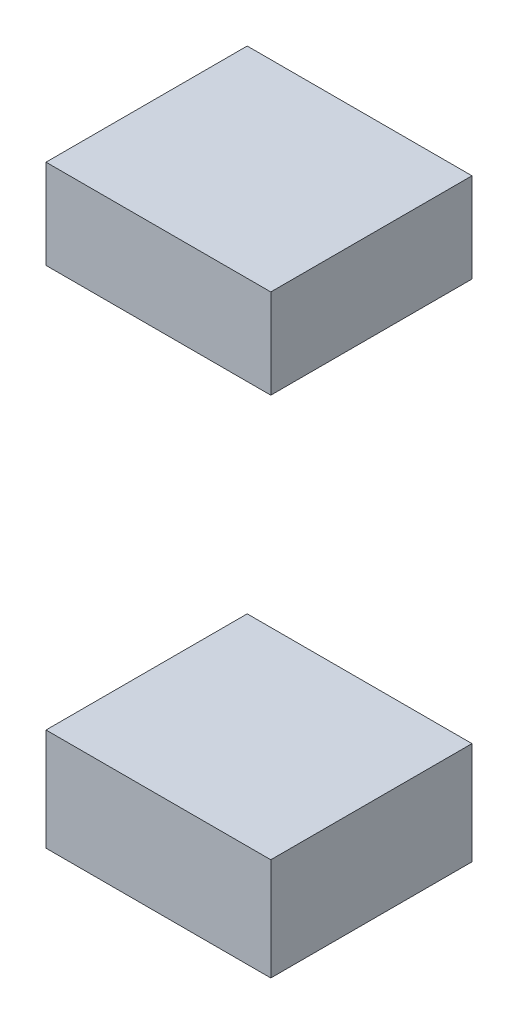
ISO-10303-21;
HEADER;
FILE_DESCRIPTION(('STEP AP214'),'2;1');
FILE_NAME('part.step','',(''),(''),'','','');
FILE_SCHEMA(('AUTOMOTIVE_DESIGN { 1 0 10303 214 1 1 1 1 }'));
ENDSEC;
DATA;
#1=APPLICATION_CONTEXT('core data for automotive mechanical design processes');
#2=APPLICATION_PROTOCOL_DEFINITION('international standard','automotive_design',2000,#1);
#3=PRODUCT_CONTEXT('',#1,'mechanical');
#4=PRODUCT('Part','Part','',(#3));
#5=PRODUCT_RELATED_PRODUCT_CATEGORY('part','',(#4));
#6=PRODUCT_DEFINITION_FORMATION('','',#4);
#7=PRODUCT_DEFINITION_CONTEXT('part definition',#1,'design');
#8=PRODUCT_DEFINITION('design','',#6,#7);
#9=PRODUCT_DEFINITION_SHAPE('','',#8);
#10=(LENGTH_UNIT() NAMED_UNIT(*) SI_UNIT(.MILLI.,.METRE.));
#11=(NAMED_UNIT(*) PLANE_ANGLE_UNIT() SI_UNIT($,.RADIAN.));
#12=(NAMED_UNIT(*) SI_UNIT($,.STERADIAN.) SOLID_ANGLE_UNIT());
#13=UNCERTAINTY_MEASURE_WITH_UNIT(LENGTH_MEASURE(1.E-05),#10,'distance_accuracy_value','');
#14=(GEOMETRIC_REPRESENTATION_CONTEXT(3) GLOBAL_UNCERTAINTY_ASSIGNED_CONTEXT((#13)) GLOBAL_UNIT_ASSIGNED_CONTEXT((#10,
#11,#12)) REPRESENTATION_CONTEXT('',''));
#15=CARTESIAN_POINT('',(0.,0.,0.));
#16=DIRECTION('',(0.,0.,1.));
#17=DIRECTION('',(1.,0.,0.));
#18=AXIS2_PLACEMENT_3D('',#15,#16,#17);
#19=CARTESIAN_POINT('',(10.5586046066208,8.77771578309206,2.));
#20=DIRECTION('',(0.,0.,1.));
#21=DIRECTION('',(1.,0.,0.));
#22=AXIS2_PLACEMENT_3D('',#19,#20,#21);
#23=PLANE('',#22);
#24=DIRECTION('',(0.,1.,0.));
#25=VECTOR('',#24,1.);
#26=CARTESIAN_POINT('',(10.0000001490116,6.04687509010546,2.));
#27=LINE('',#26,#25);
#28=CARTESIAN_POINT('',(10.0000001490116,8.55543143207368,2.));
#29=VERTEX_POINT('',#28);
#30=CARTESIAN_POINT('',(10.0000001490116,9.00000013411045,2.));
#31=VERTEX_POINT('',#30);
#32=EDGE_CURVE('P0_E28',#29,#31,#27,.T.);
#33=ORIENTED_EDGE('',*,*,#32,.T.);
#34=DIRECTION('',(1.,0.,0.));
#35=VECTOR('',#34,1.);
#36=CARTESIAN_POINT('',(10.0000001490116,9.00000013411045,2.));
#37=LINE('',#36,#35);
#38=CARTESIAN_POINT('',(11.11720906423,9.00000013411045,2.));
#39=VERTEX_POINT('',#38);
#40=EDGE_CURVE('P0_E101',#31,#39,#37,.T.);
#41=ORIENTED_EDGE('',*,*,#40,.T.);
#42=DIRECTION('',(0.,-1.,0.));
#43=VECTOR('',#42,1.);
#44=CARTESIAN_POINT('',(11.11720906423,9.00000013411045,2.));
#45=LINE('',#44,#43);
#46=CARTESIAN_POINT('',(11.11720906423,8.55543143207368,2.));
#47=VERTEX_POINT('',#46);
#48=EDGE_CURVE('P0_E21',#39,#47,#45,.T.);
#49=ORIENTED_EDGE('',*,*,#48,.T.);
#50=DIRECTION('',(1.,0.,0.));
#51=VECTOR('',#50,1.);
#52=CARTESIAN_POINT('',(10.0000001490116,8.55543143207368,2.));
#53=LINE('',#52,#51);
#54=EDGE_CURVE('P0_E73',#29,#47,#53,.T.);
#55=ORIENTED_EDGE('',*,*,#54,.F.);
#56=EDGE_LOOP('',(#33,#41,#49,#55));
#57=FACE_BOUND('',#56,.T.);
#58=ADVANCED_FACE('P0_F17',(#57),#23,.F.);
#59=CARTESIAN_POINT('',(10.5586046066208,8.77771578309206,3.));
#60=DIRECTION('',(0.,0.,1.));
#61=DIRECTION('',(1.,0.,0.));
#62=AXIS2_PLACEMENT_3D('',#59,#60,#61);
#63=PLANE('',#62);
#64=DIRECTION('',(0.,-1.,0.));
#65=VECTOR('',#64,1.);
#66=CARTESIAN_POINT('',(10.0000001490116,6.04687509010546,3.));
#67=LINE('',#66,#65);
#68=CARTESIAN_POINT('',(10.0000001490116,9.00000013411045,3.));
#69=VERTEX_POINT('',#68);
#70=CARTESIAN_POINT('',(10.0000001490116,8.55543143207368,3.));
#71=VERTEX_POINT('',#70);
#72=EDGE_CURVE('P0_E11',#69,#71,#67,.T.);
#73=ORIENTED_EDGE('',*,*,#72,.T.);
#74=DIRECTION('',(1.,0.,0.));
#75=VECTOR('',#74,1.);
#76=CARTESIAN_POINT('',(10.0000001490116,8.55543143207368,3.));
#77=LINE('',#76,#75);
#78=CARTESIAN_POINT('',(11.11720906423,8.55543143207368,3.));
#79=VERTEX_POINT('',#78);
#80=EDGE_CURVE('P0_E63',#71,#79,#77,.T.);
#81=ORIENTED_EDGE('',*,*,#80,.T.);
#82=DIRECTION('',(0.,1.,0.));
#83=VECTOR('',#82,1.);
#84=CARTESIAN_POINT('',(11.11720906423,9.00000013411045,3.));
#85=LINE('',#84,#83);
#86=CARTESIAN_POINT('',(11.11720906423,9.00000013411045,3.));
#87=VERTEX_POINT('',#86);
#88=EDGE_CURVE('P0_E67',#79,#87,#85,.T.);
#89=ORIENTED_EDGE('',*,*,#88,.T.);
#90=DIRECTION('',(-1.,0.,0.));
#91=VECTOR('',#90,1.);
#92=CARTESIAN_POINT('',(10.0000001490116,9.00000013411045,3.));
#93=LINE('',#92,#91);
#94=EDGE_CURVE('P0_E98',#87,#69,#93,.T.);
#95=ORIENTED_EDGE('',*,*,#94,.T.);
#96=EDGE_LOOP('',(#73,#81,#89,#95));
#97=FACE_BOUND('',#96,.T.);
#98=ADVANCED_FACE('P0_F65',(#97),#63,.T.);
#99=CARTESIAN_POINT('',(10.0000001490116,9.00000013411045,2.));
#100=DIRECTION('',(-1.,0.,0.));
#101=DIRECTION('',(0.,0.,1.));
#102=AXIS2_PLACEMENT_3D('',#99,#100,#101);
#103=PLANE('',#102);
#104=ORIENTED_EDGE('',*,*,#32,.F.);
#105=DIRECTION('',(0.,0.,1.));
#106=VECTOR('',#105,1.);
#107=CARTESIAN_POINT('',(10.0000001490116,8.55543143207368,2.));
#108=LINE('',#107,#106);
#109=EDGE_CURVE('P0_E72',#29,#71,#108,.T.);
#110=ORIENTED_EDGE('',*,*,#109,.T.);
#111=ORIENTED_EDGE('',*,*,#72,.F.);
#112=DIRECTION('',(0.,0.,1.));
#113=VECTOR('',#112,1.);
#114=CARTESIAN_POINT('',(10.0000001490116,9.00000013411045,2.));
#115=LINE('',#114,#113);
#116=EDGE_CURVE('P0_E104',#31,#69,#115,.T.);
#117=ORIENTED_EDGE('',*,*,#116,.F.);
#118=EDGE_LOOP('',(#104,#110,#111,#117));
#119=FACE_BOUND('',#118,.T.);
#120=ADVANCED_FACE('P0_F115',(#119),#103,.T.);
#121=CARTESIAN_POINT('',(10.0000001490116,8.55543143207368,2.));
#122=DIRECTION('',(0.,-1.,0.));
#123=DIRECTION('',(0.,0.,-1.));
#124=AXIS2_PLACEMENT_3D('',#121,#122,#123);
#125=PLANE('',#124);
#126=ORIENTED_EDGE('',*,*,#54,.T.);
#127=DIRECTION('',(0.,0.,1.));
#128=VECTOR('',#127,1.);
#129=CARTESIAN_POINT('',(11.11720906423,8.55543143207368,2.));
#130=LINE('',#129,#128);
#131=EDGE_CURVE('P0_E76',#47,#79,#130,.T.);
#132=ORIENTED_EDGE('',*,*,#131,.T.);
#133=ORIENTED_EDGE('',*,*,#80,.F.);
#134=ORIENTED_EDGE('',*,*,#109,.F.);
#135=EDGE_LOOP('',(#126,#132,#133,#134));
#136=FACE_BOUND('',#135,.T.);
#137=ADVANCED_FACE('P0_F19',(#136),#125,.T.);
#138=CARTESIAN_POINT('',(11.11720906423,8.55543143207368,2.));
#139=DIRECTION('',(1.,0.,0.));
#140=DIRECTION('',(0.,1.,0.));
#141=AXIS2_PLACEMENT_3D('',#138,#139,#140);
#142=PLANE('',#141);
#143=ORIENTED_EDGE('',*,*,#48,.F.);
#144=DIRECTION('',(0.,0.,1.));
#145=VECTOR('',#144,1.);
#146=CARTESIAN_POINT('',(11.11720906423,9.00000013411045,2.));
#147=LINE('',#146,#145);
#148=EDGE_CURVE('P0_E85',#39,#87,#147,.T.);
#149=ORIENTED_EDGE('',*,*,#148,.T.);
#150=ORIENTED_EDGE('',*,*,#88,.F.);
#151=ORIENTED_EDGE('',*,*,#131,.F.);
#152=EDGE_LOOP('',(#143,#149,#150,#151));
#153=FACE_BOUND('',#152,.T.);
#154=ADVANCED_FACE('P0_F83',(#153),#142,.T.);
#155=CARTESIAN_POINT('',(11.11720906423,9.00000013411045,2.));
#156=DIRECTION('',(0.,1.,0.));
#157=DIRECTION('',(1.,0.,0.));
#158=AXIS2_PLACEMENT_3D('',#155,#156,#157);
#159=PLANE('',#158);
#160=ORIENTED_EDGE('',*,*,#40,.F.);
#161=ORIENTED_EDGE('',*,*,#116,.T.);
#162=ORIENTED_EDGE('',*,*,#94,.F.);
#163=ORIENTED_EDGE('',*,*,#148,.F.);
#164=EDGE_LOOP('',(#160,#161,#162,#163));
#165=FACE_BOUND('',#164,.T.);
#166=ADVANCED_FACE('P0_F113',(#165),#159,.T.);
#167=CLOSED_SHELL('',(#58,#98,#120,#137,#154,#166));
#168=MANIFOLD_SOLID_BREP('P0_B1',#167);
#169=CARTESIAN_POINT('',(10.5586046066208,6.30136829700765,2.));
#170=DIRECTION('',(0.,0.,1.));
#171=DIRECTION('',(1.,0.,0.));
#172=AXIS2_PLACEMENT_3D('',#169,#170,#171);
#173=PLANE('',#172);
#174=DIRECTION('',(0.,-1.,0.));
#175=VECTOR('',#174,1.);
#176=CARTESIAN_POINT('',(11.11720906423,9.00000013411045,2.));
#177=LINE('',#176,#175);
#178=CARTESIAN_POINT('',(11.11720906423,6.55586150390983,2.));
#179=VERTEX_POINT('',#178);
#180=CARTESIAN_POINT('',(11.11720906423,6.04687509010546,2.));
#181=VERTEX_POINT('',#180);
#182=EDGE_CURVE('P1_E28',#179,#181,#177,.T.);
#183=ORIENTED_EDGE('',*,*,#182,.T.);
#184=DIRECTION('',(-1.,0.,0.));
#185=VECTOR('',#184,1.);
#186=CARTESIAN_POINT('',(11.11720906423,6.04687509010546,2.));
#187=LINE('',#186,#185);
#188=CARTESIAN_POINT('',(10.0000001490116,6.04687509010546,2.));
#189=VERTEX_POINT('',#188);
#190=EDGE_CURVE('P1_E68',#181,#189,#187,.T.);
#191=ORIENTED_EDGE('',*,*,#190,.T.);
#192=DIRECTION('',(0.,1.,0.));
#193=VECTOR('',#192,1.);
#194=CARTESIAN_POINT('',(10.0000001490116,6.04687509010546,2.));
#195=LINE('',#194,#193);
#196=CARTESIAN_POINT('',(10.0000001490116,6.55586150390983,2.));
#197=VERTEX_POINT('',#196);
#198=EDGE_CURVE('P1_E100',#189,#197,#195,.T.);
#199=ORIENTED_EDGE('',*,*,#198,.T.);
#200=DIRECTION('',(-1.,0.,0.));
#201=VECTOR('',#200,1.);
#202=CARTESIAN_POINT('',(11.11720906423,6.55586150390983,2.));
#203=LINE('',#202,#201);
#204=EDGE_CURVE('P1_E70',#179,#197,#203,.T.);
#205=ORIENTED_EDGE('',*,*,#204,.F.);
#206=EDGE_LOOP('',(#183,#191,#199,#205));
#207=FACE_BOUND('',#206,.T.);
#208=ADVANCED_FACE('P1_F17',(#207),#173,.F.);
#209=CARTESIAN_POINT('',(10.5586046066208,6.30136829700765,3.));
#210=DIRECTION('',(0.,0.,1.));
#211=DIRECTION('',(1.,0.,0.));
#212=AXIS2_PLACEMENT_3D('',#209,#210,#211);
#213=PLANE('',#212);
#214=DIRECTION('',(0.,1.,0.));
#215=VECTOR('',#214,1.);
#216=CARTESIAN_POINT('',(11.11720906423,9.00000013411045,3.));
#217=LINE('',#216,#215);
#218=CARTESIAN_POINT('',(11.11720906423,6.04687509010546,3.));
#219=VERTEX_POINT('',#218);
#220=CARTESIAN_POINT('',(11.11720906423,6.55586150390983,3.));
#221=VERTEX_POINT('',#220);
#222=EDGE_CURVE('P1_E11',#219,#221,#217,.T.);
#223=ORIENTED_EDGE('',*,*,#222,.T.);
#224=DIRECTION('',(-1.,0.,0.));
#225=VECTOR('',#224,1.);
#226=CARTESIAN_POINT('',(11.11720906423,6.55586150390983,3.));
#227=LINE('',#226,#225);
#228=CARTESIAN_POINT('',(10.0000001490116,6.55586150390983,3.));
#229=VERTEX_POINT('',#228);
#230=EDGE_CURVE('P1_E94',#221,#229,#227,.T.);
#231=ORIENTED_EDGE('',*,*,#230,.T.);
#232=DIRECTION('',(0.,-1.,0.));
#233=VECTOR('',#232,1.);
#234=CARTESIAN_POINT('',(10.0000001490116,6.04687509010546,3.));
#235=LINE('',#234,#233);
#236=CARTESIAN_POINT('',(10.0000001490116,6.04687509010546,3.));
#237=VERTEX_POINT('',#236);
#238=EDGE_CURVE('P1_E96',#229,#237,#235,.T.);
#239=ORIENTED_EDGE('',*,*,#238,.T.);
#240=DIRECTION('',(1.,0.,0.));
#241=VECTOR('',#240,1.);
#242=CARTESIAN_POINT('',(11.11720906423,6.04687509010546,3.));
#243=LINE('',#242,#241);
#244=EDGE_CURVE('P1_E21',#237,#219,#243,.T.);
#245=ORIENTED_EDGE('',*,*,#244,.T.);
#246=EDGE_LOOP('',(#223,#231,#239,#245));
#247=FACE_BOUND('',#246,.T.);
#248=ADVANCED_FACE('P1_F113',(#247),#213,.T.);
#249=CARTESIAN_POINT('',(11.11720906423,6.04687509010546,2.));
#250=DIRECTION('',(1.,0.,0.));
#251=DIRECTION('',(0.,1.,0.));
#252=AXIS2_PLACEMENT_3D('',#249,#250,#251);
#253=PLANE('',#252);
#254=ORIENTED_EDGE('',*,*,#182,.F.);
#255=DIRECTION('',(0.,0.,1.));
#256=VECTOR('',#255,1.);
#257=CARTESIAN_POINT('',(11.11720906423,6.55586150390983,2.));
#258=LINE('',#257,#256);
#259=EDGE_CURVE('P1_E74',#179,#221,#258,.T.);
#260=ORIENTED_EDGE('',*,*,#259,.T.);
#261=ORIENTED_EDGE('',*,*,#222,.F.);
#262=DIRECTION('',(0.,0.,1.));
#263=VECTOR('',#262,1.);
#264=CARTESIAN_POINT('',(11.11720906423,6.04687509010546,2.));
#265=LINE('',#264,#263);
#266=EDGE_CURVE('P1_E77',#181,#219,#265,.T.);
#267=ORIENTED_EDGE('',*,*,#266,.F.);
#268=EDGE_LOOP('',(#254,#260,#261,#267));
#269=FACE_BOUND('',#268,.T.);
#270=ADVANCED_FACE('P1_F78',(#269),#253,.T.);
#271=CARTESIAN_POINT('',(11.11720906423,6.55586150390983,2.));
#272=DIRECTION('',(0.,1.,0.));
#273=DIRECTION('',(1.,0.,0.));
#274=AXIS2_PLACEMENT_3D('',#271,#272,#273);
#275=PLANE('',#274);
#276=ORIENTED_EDGE('',*,*,#204,.T.);
#277=DIRECTION('',(0.,0.,1.));
#278=VECTOR('',#277,1.);
#279=CARTESIAN_POINT('',(10.0000001490116,6.55586150390983,2.));
#280=LINE('',#279,#278);
#281=EDGE_CURVE('P1_E99',#197,#229,#280,.T.);
#282=ORIENTED_EDGE('',*,*,#281,.T.);
#283=ORIENTED_EDGE('',*,*,#230,.F.);
#284=ORIENTED_EDGE('',*,*,#259,.F.);
#285=EDGE_LOOP('',(#276,#282,#283,#284));
#286=FACE_BOUND('',#285,.T.);
#287=ADVANCED_FACE('P1_F115',(#286),#275,.T.);
#288=CARTESIAN_POINT('',(10.0000001490116,6.55586150390983,2.));
#289=DIRECTION('',(-1.,0.,0.));
#290=DIRECTION('',(0.,0.,1.));
#291=AXIS2_PLACEMENT_3D('',#288,#289,#290);
#292=PLANE('',#291);
#293=ORIENTED_EDGE('',*,*,#198,.F.);
#294=DIRECTION('',(0.,0.,1.));
#295=VECTOR('',#294,1.);
#296=CARTESIAN_POINT('',(10.0000001490116,6.04687509010546,2.));
#297=LINE('',#296,#295);
#298=EDGE_CURVE('P1_E85',#189,#237,#297,.T.);
#299=ORIENTED_EDGE('',*,*,#298,.T.);
#300=ORIENTED_EDGE('',*,*,#238,.F.);
#301=ORIENTED_EDGE('',*,*,#281,.F.);
#302=EDGE_LOOP('',(#293,#299,#300,#301));
#303=FACE_BOUND('',#302,.T.);
#304=ADVANCED_FACE('P1_F117',(#303),#292,.T.);
#305=CARTESIAN_POINT('',(10.0000001490116,6.04687509010546,2.));
#306=DIRECTION('',(0.,-1.,0.));
#307=DIRECTION('',(0.,0.,-1.));
#308=AXIS2_PLACEMENT_3D('',#305,#306,#307);
#309=PLANE('',#308);
#310=ORIENTED_EDGE('',*,*,#190,.F.);
#311=ORIENTED_EDGE('',*,*,#266,.T.);
#312=ORIENTED_EDGE('',*,*,#244,.F.);
#313=ORIENTED_EDGE('',*,*,#298,.F.);
#314=EDGE_LOOP('',(#310,#311,#312,#313));
#315=FACE_BOUND('',#314,.T.);
#316=ADVANCED_FACE('P1_F19',(#315),#309,.T.);
#317=CLOSED_SHELL('',(#208,#248,#270,#287,#304,#316));
#318=MANIFOLD_SOLID_BREP('P1_B1',#317);
#319=ADVANCED_BREP_SHAPE_REPRESENTATION('',(#18,#168,#318),#14);
#320=SHAPE_DEFINITION_REPRESENTATION(#9,#319);
ENDSEC;
END-ISO-10303-21;
